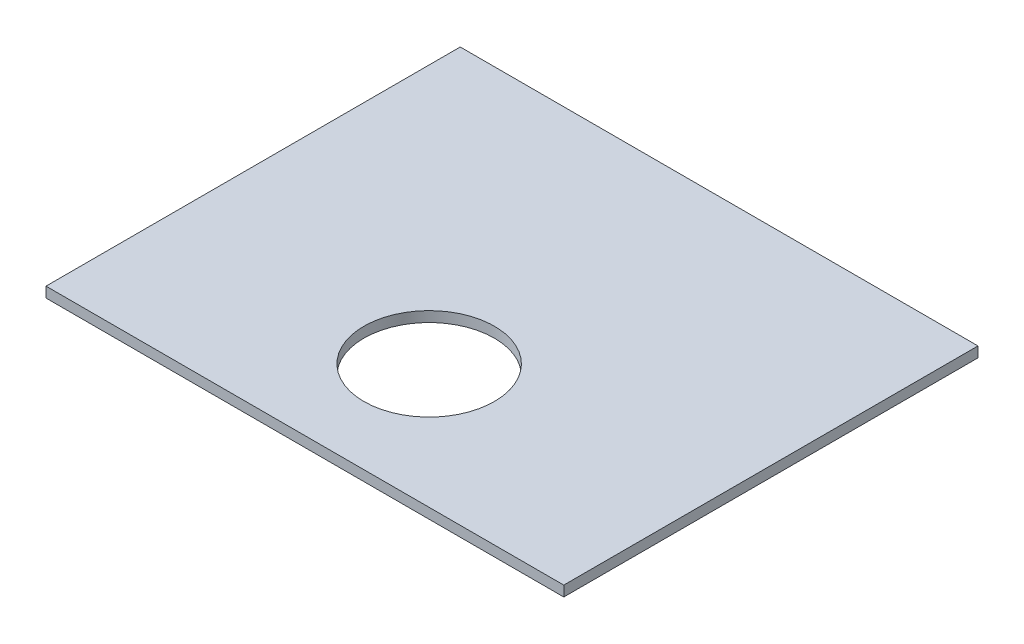
ISO-10303-21;
HEADER;
FILE_DESCRIPTION(('STEP AP214'),'2;1');
FILE_NAME('part.step','',(''),(''),'','','');
FILE_SCHEMA(('AUTOMOTIVE_DESIGN { 1 0 10303 214 1 1 1 1 }'));
ENDSEC;
DATA;
#1=APPLICATION_CONTEXT('core data for automotive mechanical design processes');
#2=APPLICATION_PROTOCOL_DEFINITION('international standard','automotive_design',2000,#1);
#3=PRODUCT_CONTEXT('',#1,'mechanical');
#4=PRODUCT('Part','Part','',(#3));
#5=PRODUCT_RELATED_PRODUCT_CATEGORY('part','',(#4));
#6=PRODUCT_DEFINITION_FORMATION('','',#4);
#7=PRODUCT_DEFINITION_CONTEXT('part definition',#1,'design');
#8=PRODUCT_DEFINITION('design','',#6,#7);
#9=PRODUCT_DEFINITION_SHAPE('','',#8);
#10=(LENGTH_UNIT() NAMED_UNIT(*) SI_UNIT(.MILLI.,.METRE.));
#11=(NAMED_UNIT(*) PLANE_ANGLE_UNIT() SI_UNIT($,.RADIAN.));
#12=(NAMED_UNIT(*) SI_UNIT($,.STERADIAN.) SOLID_ANGLE_UNIT());
#13=UNCERTAINTY_MEASURE_WITH_UNIT(LENGTH_MEASURE(1.E-05),#10,'distance_accuracy_value','');
#14=(GEOMETRIC_REPRESENTATION_CONTEXT(3) GLOBAL_UNCERTAINTY_ASSIGNED_CONTEXT((#13)) GLOBAL_UNIT_ASSIGNED_CONTEXT((#10,
#11,#12)) REPRESENTATION_CONTEXT('',''));
#15=CARTESIAN_POINT('',(0.,0.,0.));
#16=DIRECTION('',(0.,0.,1.));
#17=DIRECTION('',(1.,0.,0.));
#18=AXIS2_PLACEMENT_3D('',#15,#16,#17);
#19=CARTESIAN_POINT('',(-250.,-10.,-200.));
#20=DIRECTION('',(0.,0.,1.));
#21=DIRECTION('',(1.,0.,0.));
#22=AXIS2_PLACEMENT_3D('',#19,#20,#21);
#23=PLANE('',#22);
#24=DIRECTION('',(1.,0.,0.));
#25=VECTOR('',#24,1.);
#26=CARTESIAN_POINT('',(-250.,0.,-200.));
#27=LINE('',#26,#25);
#28=CARTESIAN_POINT('',(-250.,0.,-200.));
#29=VERTEX_POINT('',#28);
#30=CARTESIAN_POINT('',(250.,0.,-200.));
#31=VERTEX_POINT('',#30);
#32=EDGE_CURVE('E96',#29,#31,#27,.T.);
#33=ORIENTED_EDGE('',*,*,#32,.T.);
#34=DIRECTION('',(0.,1.,0.));
#35=VECTOR('',#34,1.);
#36=CARTESIAN_POINT('',(250.,-10.,-200.));
#37=LINE('',#36,#35);
#38=CARTESIAN_POINT('',(250.,-10.,-200.));
#39=VERTEX_POINT('',#38);
#40=EDGE_CURVE('E11',#39,#31,#37,.T.);
#41=ORIENTED_EDGE('',*,*,#40,.F.);
#42=DIRECTION('',(1.,0.,0.));
#43=VECTOR('',#42,1.);
#44=CARTESIAN_POINT('',(-250.,-10.,-200.));
#45=LINE('',#44,#43);
#46=CARTESIAN_POINT('',(-250.,-10.,-200.));
#47=VERTEX_POINT('',#46);
#48=EDGE_CURVE('E82',#47,#39,#45,.T.);
#49=ORIENTED_EDGE('',*,*,#48,.F.);
#50=DIRECTION('',(0.,1.,0.));
#51=VECTOR('',#50,1.);
#52=CARTESIAN_POINT('',(-250.,-10.,-200.));
#53=LINE('',#52,#51);
#54=EDGE_CURVE('E49',#47,#29,#53,.T.);
#55=ORIENTED_EDGE('',*,*,#54,.T.);
#56=EDGE_LOOP('',(#33,#41,#49,#55));
#57=FACE_BOUND('',#56,.T.);
#58=ADVANCED_FACE('F33',(#57),#23,.F.);
#59=CARTESIAN_POINT('',(250.,-10.,-200.));
#60=DIRECTION('',(-1.,0.,0.));
#61=DIRECTION('',(0.,0.,1.));
#62=AXIS2_PLACEMENT_3D('',#59,#60,#61);
#63=PLANE('',#62);
#64=DIRECTION('',(0.,0.,1.));
#65=VECTOR('',#64,1.);
#66=CARTESIAN_POINT('',(250.,0.,-200.));
#67=LINE('',#66,#65);
#68=CARTESIAN_POINT('',(250.,0.,200.));
#69=VERTEX_POINT('',#68);
#70=EDGE_CURVE('E87',#31,#69,#67,.T.);
#71=ORIENTED_EDGE('',*,*,#70,.T.);
#72=DIRECTION('',(0.,1.,0.));
#73=VECTOR('',#72,1.);
#74=CARTESIAN_POINT('',(250.,-10.,200.));
#75=LINE('',#74,#73);
#76=CARTESIAN_POINT('',(250.,-10.,200.));
#77=VERTEX_POINT('',#76);
#78=EDGE_CURVE('E41',#77,#69,#75,.T.);
#79=ORIENTED_EDGE('',*,*,#78,.F.);
#80=DIRECTION('',(0.,0.,1.));
#81=VECTOR('',#80,1.);
#82=CARTESIAN_POINT('',(250.,-10.,-200.));
#83=LINE('',#82,#81);
#84=EDGE_CURVE('E74',#39,#77,#83,.T.);
#85=ORIENTED_EDGE('',*,*,#84,.F.);
#86=ORIENTED_EDGE('',*,*,#40,.T.);
#87=EDGE_LOOP('',(#71,#79,#85,#86));
#88=FACE_BOUND('',#87,.T.);
#89=ADVANCED_FACE('F86',(#88),#63,.F.);
#90=CARTESIAN_POINT('',(-250.,-10.,200.));
#91=DIRECTION('',(0.,0.,1.));
#92=DIRECTION('',(1.,0.,0.));
#93=AXIS2_PLACEMENT_3D('',#90,#91,#92);
#94=PLANE('',#93);
#95=DIRECTION('',(1.,0.,0.));
#96=VECTOR('',#95,1.);
#97=CARTESIAN_POINT('',(-250.,0.,200.));
#98=LINE('',#97,#96);
#99=CARTESIAN_POINT('',(-250.,0.,200.));
#100=VERTEX_POINT('',#99);
#101=EDGE_CURVE('E100',#100,#69,#98,.T.);
#102=ORIENTED_EDGE('',*,*,#101,.F.);
#103=DIRECTION('',(0.,1.,0.));
#104=VECTOR('',#103,1.);
#105=CARTESIAN_POINT('',(-250.,-10.,200.));
#106=LINE('',#105,#104);
#107=CARTESIAN_POINT('',(-250.,-10.,200.));
#108=VERTEX_POINT('',#107);
#109=EDGE_CURVE('E63',#108,#100,#106,.T.);
#110=ORIENTED_EDGE('',*,*,#109,.F.);
#111=DIRECTION('',(1.,0.,0.));
#112=VECTOR('',#111,1.);
#113=CARTESIAN_POINT('',(-250.,-10.,200.));
#114=LINE('',#113,#112);
#115=EDGE_CURVE('E81',#108,#77,#114,.T.);
#116=ORIENTED_EDGE('',*,*,#115,.T.);
#117=ORIENTED_EDGE('',*,*,#78,.T.);
#118=EDGE_LOOP('',(#102,#110,#116,#117));
#119=FACE_BOUND('',#118,.T.);
#120=ADVANCED_FACE('F90',(#119),#94,.T.);
#121=CARTESIAN_POINT('',(-250.,-10.,-200.));
#122=DIRECTION('',(-1.,0.,0.));
#123=DIRECTION('',(0.,0.,1.));
#124=AXIS2_PLACEMENT_3D('',#121,#122,#123);
#125=PLANE('',#124);
#126=DIRECTION('',(0.,0.,1.));
#127=VECTOR('',#126,1.);
#128=CARTESIAN_POINT('',(-250.,0.,-200.));
#129=LINE('',#128,#127);
#130=EDGE_CURVE('E102',#29,#100,#129,.T.);
#131=ORIENTED_EDGE('',*,*,#130,.F.);
#132=ORIENTED_EDGE('',*,*,#54,.F.);
#133=DIRECTION('',(0.,0.,1.));
#134=VECTOR('',#133,1.);
#135=CARTESIAN_POINT('',(-250.,-10.,-200.));
#136=LINE('',#135,#134);
#137=EDGE_CURVE('E91',#47,#108,#136,.T.);
#138=ORIENTED_EDGE('',*,*,#137,.T.);
#139=ORIENTED_EDGE('',*,*,#109,.T.);
#140=EDGE_LOOP('',(#131,#132,#138,#139));
#141=FACE_BOUND('',#140,.T.);
#142=ADVANCED_FACE('F119',(#141),#125,.T.);
#143=CARTESIAN_POINT('',(0.,-10.,0.));
#144=DIRECTION('',(0.,-1.,0.));
#145=DIRECTION('',(0.,0.,-1.));
#146=AXIS2_PLACEMENT_3D('',#143,#144,#145);
#147=PLANE('',#146);
#148=CARTESIAN_POINT('',(0.,-10.,80.));
#149=DIRECTION('',(0.,-1.,0.));
#150=DIRECTION('',(0.,0.,-1.));
#151=AXIS2_PLACEMENT_3D('',#148,#149,#150);
#152=CIRCLE('',#151,63.);
#153=CARTESIAN_POINT('',(0.,-10.,17.));
#154=VERTEX_POINT('',#153);
#155=EDGE_CURVE('E98',#154,#154,#152,.T.);
#156=ORIENTED_EDGE('',*,*,#155,.F.);
#157=EDGE_LOOP('',(#156));
#158=FACE_BOUND('',#157,.T.);
#159=ORIENTED_EDGE('',*,*,#48,.T.);
#160=ORIENTED_EDGE('',*,*,#84,.T.);
#161=ORIENTED_EDGE('',*,*,#115,.F.);
#162=ORIENTED_EDGE('',*,*,#137,.F.);
#163=EDGE_LOOP('',(#159,#160,#161,#162));
#164=FACE_BOUND('',#163,.T.);
#165=ADVANCED_FACE('F78',(#158,#164),#147,.T.);
#166=CARTESIAN_POINT('',(0.,0.,0.));
#167=DIRECTION('',(0.,-1.,0.));
#168=DIRECTION('',(0.,0.,-1.));
#169=AXIS2_PLACEMENT_3D('',#166,#167,#168);
#170=PLANE('',#169);
#171=CARTESIAN_POINT('',(0.,0.,80.));
#172=DIRECTION('',(0.,1.,0.));
#173=DIRECTION('',(0.,0.,1.));
#174=AXIS2_PLACEMENT_3D('',#171,#172,#173);
#175=CIRCLE('',#174,63.);
#176=CARTESIAN_POINT('',(0.,0.,143.));
#177=VERTEX_POINT('',#176);
#178=EDGE_CURVE('E110',#177,#177,#175,.T.);
#179=ORIENTED_EDGE('',*,*,#178,.F.);
#180=EDGE_LOOP('',(#179));
#181=FACE_BOUND('',#180,.T.);
#182=ORIENTED_EDGE('',*,*,#32,.F.);
#183=ORIENTED_EDGE('',*,*,#130,.T.);
#184=ORIENTED_EDGE('',*,*,#101,.T.);
#185=ORIENTED_EDGE('',*,*,#70,.F.);
#186=EDGE_LOOP('',(#182,#183,#184,#185));
#187=FACE_BOUND('',#186,.T.);
#188=ADVANCED_FACE('F116',(#181,#187),#170,.F.);
#189=CARTESIAN_POINT('',(0.,-20.,80.));
#190=DIRECTION('',(0.,1.,0.));
#191=DIRECTION('',(0.,0.,1.));
#192=AXIS2_PLACEMENT_3D('',#189,#190,#191);
#193=CYLINDRICAL_SURFACE('',#192,63.);
#194=ORIENTED_EDGE('',*,*,#155,.T.);
#195=EDGE_LOOP('',(#194));
#196=FACE_BOUND('',#195,.T.);
#197=ORIENTED_EDGE('',*,*,#178,.T.);
#198=EDGE_LOOP('',(#197));
#199=FACE_BOUND('',#198,.T.);
#200=ADVANCED_FACE('F114',(#196,#199),#193,.F.);
#201=CLOSED_SHELL('',(#58,#89,#120,#142,#165,#188,#200));
#202=MANIFOLD_SOLID_BREP('B2',#201);
#203=ADVANCED_BREP_SHAPE_REPRESENTATION('',(#18,#202),#14);
#204=SHAPE_DEFINITION_REPRESENTATION(#9,#203);
ENDSEC;
END-ISO-10303-21;
